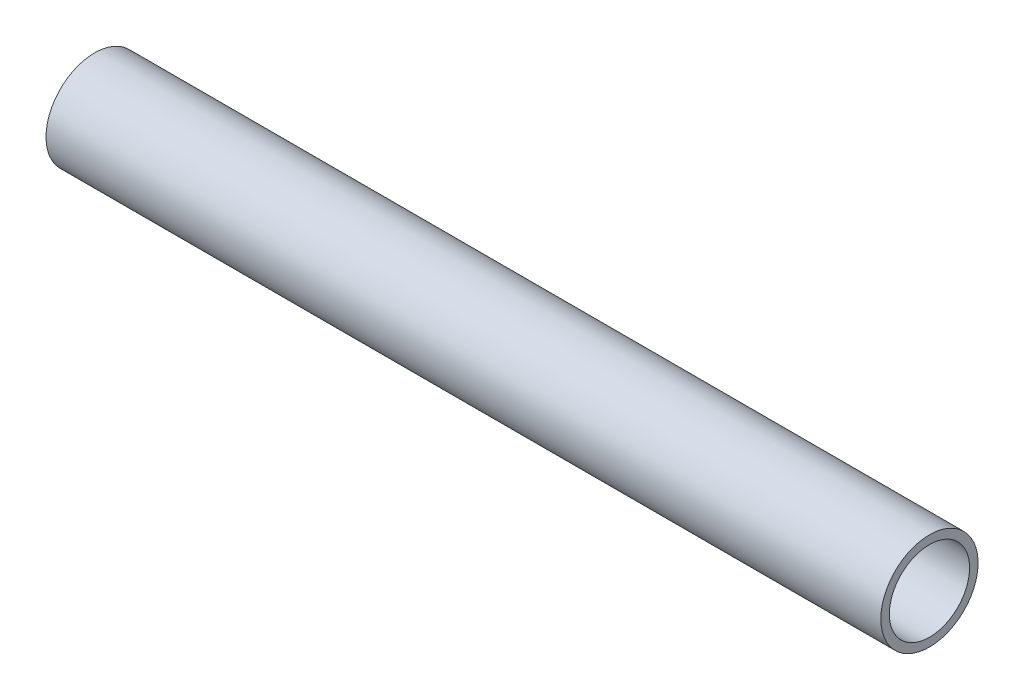
ISO-10303-21;
HEADER;
FILE_DESCRIPTION(('STEP AP214'),'2;1');
FILE_NAME('part.step','',(''),(''),'','','');
FILE_SCHEMA(('AUTOMOTIVE_DESIGN { 1 0 10303 214 1 1 1 1 }'));
ENDSEC;
DATA;
#1=APPLICATION_CONTEXT('core data for automotive mechanical design processes');
#2=APPLICATION_PROTOCOL_DEFINITION('international standard','automotive_design',2000,#1);
#3=PRODUCT_CONTEXT('',#1,'mechanical');
#4=PRODUCT('Part','Part','',(#3));
#5=PRODUCT_RELATED_PRODUCT_CATEGORY('part','',(#4));
#6=PRODUCT_DEFINITION_FORMATION('','',#4);
#7=PRODUCT_DEFINITION_CONTEXT('part definition',#1,'design');
#8=PRODUCT_DEFINITION('design','',#6,#7);
#9=PRODUCT_DEFINITION_SHAPE('','',#8);
#10=(LENGTH_UNIT() NAMED_UNIT(*) SI_UNIT(.MILLI.,.METRE.));
#11=(NAMED_UNIT(*) PLANE_ANGLE_UNIT() SI_UNIT($,.RADIAN.));
#12=(NAMED_UNIT(*) SI_UNIT($,.STERADIAN.) SOLID_ANGLE_UNIT());
#13=UNCERTAINTY_MEASURE_WITH_UNIT(LENGTH_MEASURE(1.E-05),#10,'distance_accuracy_value','');
#14=(GEOMETRIC_REPRESENTATION_CONTEXT(3) GLOBAL_UNCERTAINTY_ASSIGNED_CONTEXT((#13)) GLOBAL_UNIT_ASSIGNED_CONTEXT((#10,
#11,#12)) REPRESENTATION_CONTEXT('',''));
#15=CARTESIAN_POINT('',(0.,0.,0.));
#16=DIRECTION('',(0.,0.,1.));
#17=DIRECTION('',(1.,0.,0.));
#18=AXIS2_PLACEMENT_3D('',#15,#16,#17);
#19=CARTESIAN_POINT('',(0.,21.082,0.));
#20=DIRECTION('',(1.,0.,0.));
#21=DIRECTION('',(0.,0.,-1.));
#22=AXIS2_PLACEMENT_3D('',#19,#20,#21);
#23=PLANE('',#22);
#24=CARTESIAN_POINT('',(0.,0.,0.));
#25=DIRECTION('',(-1.,0.,0.));
#26=DIRECTION('',(0.,0.,1.));
#27=AXIS2_PLACEMENT_3D('',#24,#25,#26);
#28=CIRCLE('',#27,17.399);
#29=CARTESIAN_POINT('',(0.,0.,17.399));
#30=VERTEX_POINT('',#29);
#31=EDGE_CURVE('E10',#30,#30,#28,.T.);
#32=ORIENTED_EDGE('',*,*,#31,.F.);
#33=EDGE_LOOP('',(#32));
#34=FACE_BOUND('',#33,.T.);
#35=CARTESIAN_POINT('',(0.,0.,0.));
#36=DIRECTION('',(-1.,0.,0.));
#37=DIRECTION('',(0.,0.,1.));
#38=AXIS2_PLACEMENT_3D('',#35,#36,#37);
#39=CIRCLE('',#38,21.082);
#40=CARTESIAN_POINT('',(0.,0.,21.082));
#41=VERTEX_POINT('',#40);
#42=EDGE_CURVE('E45',#41,#41,#39,.T.);
#43=ORIENTED_EDGE('',*,*,#42,.T.);
#44=EDGE_LOOP('',(#43));
#45=FACE_BOUND('',#44,.T.);
#46=ADVANCED_FACE('F31',(#34,#45),#23,.F.);
#47=CARTESIAN_POINT('',(-17.6610900080415,0.,0.));
#48=DIRECTION('',(-1.,0.,0.));
#49=DIRECTION('',(0.,0.,1.));
#50=AXIS2_PLACEMENT_3D('',#47,#48,#49);
#51=CYLINDRICAL_SURFACE('',#50,17.399);
#52=CARTESIAN_POINT('',(361.95,0.,0.));
#53=DIRECTION('',(-1.,0.,0.));
#54=DIRECTION('',(0.,0.,1.));
#55=AXIS2_PLACEMENT_3D('',#52,#53,#54);
#56=CIRCLE('',#55,17.399);
#57=CARTESIAN_POINT('',(361.95,0.,17.399));
#58=VERTEX_POINT('',#57);
#59=EDGE_CURVE('E37',#58,#58,#56,.T.);
#60=ORIENTED_EDGE('',*,*,#59,.F.);
#61=EDGE_LOOP('',(#60));
#62=FACE_BOUND('',#61,.T.);
#63=ORIENTED_EDGE('',*,*,#31,.T.);
#64=EDGE_LOOP('',(#63));
#65=FACE_BOUND('',#64,.T.);
#66=ADVANCED_FACE('F60',(#62,#65),#51,.F.);
#67=CARTESIAN_POINT('',(361.95,21.082,0.));
#68=DIRECTION('',(-1.,0.,0.));
#69=DIRECTION('',(0.,0.,1.));
#70=AXIS2_PLACEMENT_3D('',#67,#68,#69);
#71=PLANE('',#70);
#72=CARTESIAN_POINT('',(361.95,0.,0.));
#73=DIRECTION('',(-1.,0.,0.));
#74=DIRECTION('',(0.,0.,1.));
#75=AXIS2_PLACEMENT_3D('',#72,#73,#74);
#76=CIRCLE('',#75,21.082);
#77=CARTESIAN_POINT('',(361.95,0.,21.082));
#78=VERTEX_POINT('',#77);
#79=EDGE_CURVE('E41',#78,#78,#76,.T.);
#80=ORIENTED_EDGE('',*,*,#79,.F.);
#81=EDGE_LOOP('',(#80));
#82=FACE_BOUND('',#81,.T.);
#83=ORIENTED_EDGE('',*,*,#59,.T.);
#84=EDGE_LOOP('',(#83));
#85=FACE_BOUND('',#84,.T.);
#86=ADVANCED_FACE('F55',(#82,#85),#71,.F.);
#87=CARTESIAN_POINT('',(-17.6610900080415,0.,0.));
#88=DIRECTION('',(-1.,0.,0.));
#89=DIRECTION('',(0.,0.,1.));
#90=AXIS2_PLACEMENT_3D('',#87,#88,#89);
#91=CYLINDRICAL_SURFACE('',#90,21.082);
#92=ORIENTED_EDGE('',*,*,#42,.F.);
#93=EDGE_LOOP('',(#92));
#94=FACE_BOUND('',#93,.T.);
#95=ORIENTED_EDGE('',*,*,#79,.T.);
#96=EDGE_LOOP('',(#95));
#97=FACE_BOUND('',#96,.T.);
#98=ADVANCED_FACE('F52',(#94,#97),#91,.T.);
#99=CLOSED_SHELL('',(#46,#66,#86,#98));
#100=MANIFOLD_SOLID_BREP('B2',#99);
#101=ADVANCED_BREP_SHAPE_REPRESENTATION('',(#18,#100),#14);
#102=SHAPE_DEFINITION_REPRESENTATION(#9,#101);
ENDSEC;
END-ISO-10303-21;
